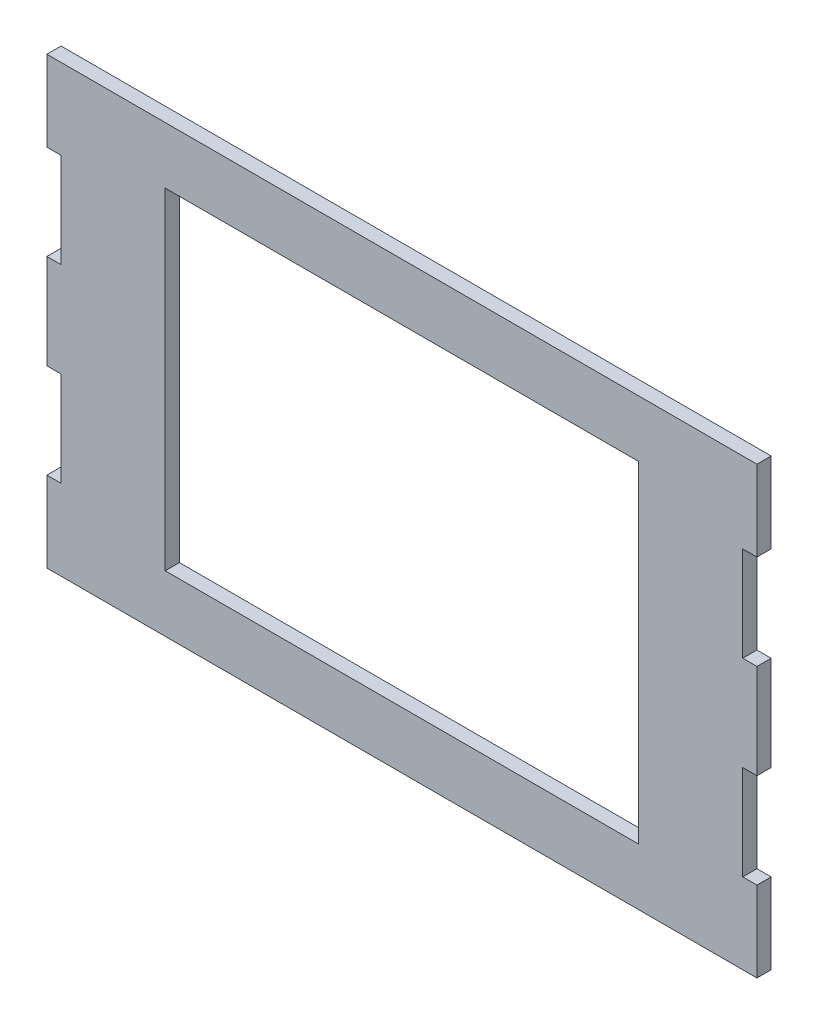
ISO-10303-21;
HEADER;
FILE_DESCRIPTION(('STEP AP214'),'2;1');
FILE_NAME('part.step','',(''),(''),'','','');
FILE_SCHEMA(('AUTOMOTIVE_DESIGN { 1 0 10303 214 1 1 1 1 }'));
ENDSEC;
DATA;
#1=APPLICATION_CONTEXT('core data for automotive mechanical design processes');
#2=APPLICATION_PROTOCOL_DEFINITION('international standard','automotive_design',2000,#1);
#3=PRODUCT_CONTEXT('',#1,'mechanical');
#4=PRODUCT('Part','Part','',(#3));
#5=PRODUCT_RELATED_PRODUCT_CATEGORY('part','',(#4));
#6=PRODUCT_DEFINITION_FORMATION('','',#4);
#7=PRODUCT_DEFINITION_CONTEXT('part definition',#1,'design');
#8=PRODUCT_DEFINITION('design','',#6,#7);
#9=PRODUCT_DEFINITION_SHAPE('','',#8);
#10=(LENGTH_UNIT() NAMED_UNIT(*) SI_UNIT(.MILLI.,.METRE.));
#11=(NAMED_UNIT(*) PLANE_ANGLE_UNIT() SI_UNIT($,.RADIAN.));
#12=(NAMED_UNIT(*) SI_UNIT($,.STERADIAN.) SOLID_ANGLE_UNIT());
#13=UNCERTAINTY_MEASURE_WITH_UNIT(LENGTH_MEASURE(1.E-05),#10,'distance_accuracy_value','');
#14=(GEOMETRIC_REPRESENTATION_CONTEXT(3) GLOBAL_UNCERTAINTY_ASSIGNED_CONTEXT((#13)) GLOBAL_UNIT_ASSIGNED_CONTEXT((#10,
#11,#12)) REPRESENTATION_CONTEXT('',''));
#15=CARTESIAN_POINT('',(0.,0.,0.));
#16=DIRECTION('',(0.,0.,1.));
#17=DIRECTION('',(1.,0.,0.));
#18=AXIS2_PLACEMENT_3D('',#15,#16,#17);
#19=CARTESIAN_POINT('',(75.,-50.,3.));
#20=DIRECTION('',(-1.,0.,0.));
#21=DIRECTION('',(0.,0.,1.));
#22=AXIS2_PLACEMENT_3D('',#19,#20,#21);
#23=PLANE('',#22);
#24=DIRECTION('',(-1.76932311390028E-12,0.,1.));
#25=VECTOR('',#24,1.);
#26=CARTESIAN_POINT('',(75.0000000008151,-47.0000000001453,-396.999999999999));
#27=LINE('',#26,#25);
#28=CARTESIAN_POINT('',(75.0000000001127,-47.0000000001452,8.32667268468867E-13));
#29=VERTEX_POINT('',#28);
#30=CARTESIAN_POINT('',(75.0000000001073,-47.0000000001452,3.00000000000084));
#31=VERTEX_POINT('',#30);
#32=EDGE_CURVE('E329',#29,#31,#27,.T.);
#33=ORIENTED_EDGE('',*,*,#32,.F.);
#34=DIRECTION('',(0.,1.,0.));
#35=VECTOR('',#34,1.);
#36=CARTESIAN_POINT('',(75.,-50.,0.));
#37=LINE('',#36,#35);
#38=CARTESIAN_POINT('',(75.0000000000929,-30.0000000001452,8.32667268468867E-13));
#39=VERTEX_POINT('',#38);
#40=EDGE_CURVE('E351',#29,#39,#37,.T.);
#41=ORIENTED_EDGE('',*,*,#40,.T.);
#42=DIRECTION('',(-1.76932311390034E-12,0.,1.));
#43=VECTOR('',#42,1.);
#44=CARTESIAN_POINT('',(75.0000000000876,-30.000000000145,3.00000000000084));
#45=LINE('',#44,#43);
#46=CARTESIAN_POINT('',(75.0000000000876,-30.000000000145,3.00000000000084));
#47=VERTEX_POINT('',#46);
#48=EDGE_CURVE('E264',#39,#47,#45,.T.);
#49=ORIENTED_EDGE('',*,*,#48,.T.);
#50=DIRECTION('',(0.,1.,0.));
#51=VECTOR('',#50,1.);
#52=CARTESIAN_POINT('',(75.,-50.,3.));
#53=LINE('',#52,#51);
#54=EDGE_CURVE('E342',#31,#47,#53,.T.);
#55=ORIENTED_EDGE('',*,*,#54,.F.);
#56=EDGE_LOOP('',(#33,#41,#49,#55));
#57=FACE_BOUND('',#56,.T.);
#58=ADVANCED_FACE('F37',(#57),#23,.F.);
#59=DIRECTION('',(1.76932311390027E-12,0.,-1.));
#60=VECTOR('',#59,1.);
#61=CARTESIAN_POINT('',(74.9999999999926,46.9999999998519,3.00000000000084));
#62=LINE('',#61,#60);
#63=CARTESIAN_POINT('',(74.9999999999926,46.9999999998519,3.00000000000084));
#64=VERTEX_POINT('',#63);
#65=CARTESIAN_POINT('',(74.9999999999968,46.999999999855,8.32667268468867E-13));
#66=VERTEX_POINT('',#65);
#67=EDGE_CURVE('E229',#64,#66,#62,.T.);
#68=ORIENTED_EDGE('',*,*,#67,.F.);
#69=CARTESIAN_POINT('',(75.0000000000127,29.999999999855,3.00000000000084));
#70=VERTEX_POINT('',#69);
#71=EDGE_CURVE('E337',#70,#64,#53,.T.);
#72=ORIENTED_EDGE('',*,*,#71,.F.);
#73=DIRECTION('',(1.76932311390027E-12,0.,-1.));
#74=VECTOR('',#73,1.);
#75=CARTESIAN_POINT('',(75.0000000000127,29.999999999855,3.00000000000084));
#76=LINE('',#75,#74);
#77=CARTESIAN_POINT('',(75.000000000018,29.999999999855,8.32667268468867E-13));
#78=VERTEX_POINT('',#77);
#79=EDGE_CURVE('E247',#70,#78,#76,.T.);
#80=ORIENTED_EDGE('',*,*,#79,.T.);
#81=EDGE_CURVE('E336',#78,#66,#37,.T.);
#82=ORIENTED_EDGE('',*,*,#81,.T.);
#83=EDGE_LOOP('',(#68,#72,#80,#82));
#84=FACE_BOUND('',#83,.T.);
#85=ADVANCED_FACE('F412',(#84),#23,.F.);
#86=CARTESIAN_POINT('',(75.0000000000679,-10.0000000001452,8.04911692853238E-13));
#87=VERTEX_POINT('',#86);
#88=CARTESIAN_POINT('',(75.000000000043,9.99999999985498,8.04911692853238E-13));
#89=VERTEX_POINT('',#88);
#90=EDGE_CURVE('E350',#87,#89,#37,.T.);
#91=ORIENTED_EDGE('',*,*,#90,.T.);
#92=DIRECTION('',(-1.76932311390027E-12,0.,1.));
#93=VECTOR('',#92,1.);
#94=CARTESIAN_POINT('',(75.0000000000377,9.99999999985498,3.00000000000084));
#95=LINE('',#94,#93);
#96=CARTESIAN_POINT('',(75.0000000000377,9.99999999985498,3.00000000000084));
#97=VERTEX_POINT('',#96);
#98=EDGE_CURVE('E265',#89,#97,#95,.T.);
#99=ORIENTED_EDGE('',*,*,#98,.T.);
#100=CARTESIAN_POINT('',(75.0000000000626,-10.0000000001452,3.00000000000084));
#101=VERTEX_POINT('',#100);
#102=EDGE_CURVE('E340',#101,#97,#53,.T.);
#103=ORIENTED_EDGE('',*,*,#102,.F.);
#104=DIRECTION('',(1.76932311390028E-12,0.,-1.));
#105=VECTOR('',#104,1.);
#106=CARTESIAN_POINT('',(75.0000000000626,-10.0000000001452,3.00000000000084));
#107=LINE('',#106,#105);
#108=EDGE_CURVE('E246',#101,#87,#107,.T.);
#109=ORIENTED_EDGE('',*,*,#108,.T.);
#110=EDGE_LOOP('',(#91,#99,#103,#109));
#111=FACE_BOUND('',#110,.T.);
#112=ADVANCED_FACE('F421',(#111),#23,.F.);
#113=CARTESIAN_POINT('',(-75.,-50.,3.));
#114=DIRECTION('',(1.,0.,0.));
#115=DIRECTION('',(0.,0.,-1.));
#116=AXIS2_PLACEMENT_3D('',#113,#114,#115);
#117=PLANE('',#116);
#118=DIRECTION('',(1.76932311390028E-12,0.,-1.));
#119=VECTOR('',#118,1.);
#120=CARTESIAN_POINT('',(-74.9999999991849,-47.000000000332,-397.000000000265));
#121=LINE('',#120,#119);
#122=CARTESIAN_POINT('',(-74.9999999998927,-47.000000000332,2.99999999973544));
#123=VERTEX_POINT('',#122);
#124=CARTESIAN_POINT('',(-74.9999999998819,-47.0000000003334,-2.65454325187875E-10));
#125=VERTEX_POINT('',#124);
#126=EDGE_CURVE('E333',#123,#125,#121,.T.);
#127=ORIENTED_EDGE('',*,*,#126,.F.);
#128=DIRECTION('',(0.,-1.,0.));
#129=VECTOR('',#128,1.);
#130=CARTESIAN_POINT('',(-75.,-50.,3.));
#131=LINE('',#130,#129);
#132=CARTESIAN_POINT('',(-74.9999999999084,-30.0000000003334,2.99999999973455));
#133=VERTEX_POINT('',#132);
#134=EDGE_CURVE('E343',#133,#123,#131,.T.);
#135=ORIENTED_EDGE('',*,*,#134,.F.);
#136=DIRECTION('',(-1.76932311390034E-12,0.,1.));
#137=VECTOR('',#136,1.);
#138=CARTESIAN_POINT('',(-74.9999999999084,-30.0000000003334,2.99999999973455));
#139=LINE('',#138,#137);
#140=CARTESIAN_POINT('',(-74.9999999999031,-30.0000000003335,-2.65454325187875E-10));
#141=VERTEX_POINT('',#140);
#142=EDGE_CURVE('E322',#141,#133,#139,.T.);
#143=ORIENTED_EDGE('',*,*,#142,.F.);
#144=DIRECTION('',(0.,-1.,0.));
#145=VECTOR('',#144,1.);
#146=CARTESIAN_POINT('',(-75.,-50.,0.));
#147=LINE('',#146,#145);
#148=EDGE_CURVE('E352',#141,#125,#147,.T.);
#149=ORIENTED_EDGE('',*,*,#148,.T.);
#150=EDGE_LOOP('',(#127,#135,#143,#149));
#151=FACE_BOUND('',#150,.T.);
#152=ADVANCED_FACE('F445',(#151),#117,.F.);
#153=DIRECTION('',(1.76932311390028E-12,0.,-1.));
#154=VECTOR('',#153,1.);
#155=CARTESIAN_POINT('',(-74.9999999999334,-10.0000000003335,2.99999999973455));
#156=LINE('',#155,#154);
#157=CARTESIAN_POINT('',(-74.9999999999334,-10.0000000003335,2.99999999973455));
#158=VERTEX_POINT('',#157);
#159=CARTESIAN_POINT('',(-74.9999999999281,-10.0000000003335,-2.65482080763491E-10));
#160=VERTEX_POINT('',#159);
#161=EDGE_CURVE('E315',#158,#160,#156,.T.);
#162=ORIENTED_EDGE('',*,*,#161,.F.);
#163=CARTESIAN_POINT('',(-74.9999999999583,9.99999999966665,2.99999999973455));
#164=VERTEX_POINT('',#163);
#165=EDGE_CURVE('E346',#164,#158,#131,.T.);
#166=ORIENTED_EDGE('',*,*,#165,.F.);
#167=DIRECTION('',(-1.76932311390027E-12,0.,1.));
#168=VECTOR('',#167,1.);
#169=CARTESIAN_POINT('',(-74.9999999999583,9.99999999966665,2.99999999973455));
#170=LINE('',#169,#168);
#171=CARTESIAN_POINT('',(-74.999999999953,9.99999999966665,-2.65482080763491E-10));
#172=VERTEX_POINT('',#171);
#173=EDGE_CURVE('E302',#172,#164,#170,.T.);
#174=ORIENTED_EDGE('',*,*,#173,.F.);
#175=EDGE_CURVE('E355',#172,#160,#147,.T.);
#176=ORIENTED_EDGE('',*,*,#175,.T.);
#177=EDGE_LOOP('',(#162,#166,#174,#176));
#178=FACE_BOUND('',#177,.T.);
#179=ADVANCED_FACE('F394',(#178),#117,.F.);
#180=DIRECTION('',(1.76932311390027E-12,0.,-1.));
#181=VECTOR('',#180,1.);
#182=CARTESIAN_POINT('',(-74.9999999999833,29.9999999996666,2.99999999973455));
#183=LINE('',#182,#181);
#184=CARTESIAN_POINT('',(-74.9999999999833,29.9999999996666,2.99999999973455));
#185=VERTEX_POINT('',#184);
#186=CARTESIAN_POINT('',(-74.999999999978,29.9999999996666,-2.65454325187875E-10));
#187=VERTEX_POINT('',#186);
#188=EDGE_CURVE('E290',#185,#187,#183,.T.);
#189=ORIENTED_EDGE('',*,*,#188,.F.);
#190=CARTESIAN_POINT('',(-75.0000000000074,46.9999999996652,2.99999999973544));
#191=VERTEX_POINT('',#190);
#192=EDGE_CURVE('E347',#191,#185,#131,.T.);
#193=ORIENTED_EDGE('',*,*,#192,.F.);
#194=DIRECTION('',(-1.76932311390027E-12,0.,1.));
#195=VECTOR('',#194,1.);
#196=CARTESIAN_POINT('',(-75.0000000000074,46.9999999996652,2.99999999973544));
#197=LINE('',#196,#195);
#198=CARTESIAN_POINT('',(-75.0000000000021,46.9999999996652,-2.65454325187875E-10));
#199=VERTEX_POINT('',#198);
#200=EDGE_CURVE('E235',#199,#191,#197,.T.);
#201=ORIENTED_EDGE('',*,*,#200,.F.);
#202=EDGE_CURVE('E341',#199,#187,#147,.T.);
#203=ORIENTED_EDGE('',*,*,#202,.T.);
#204=EDGE_LOOP('',(#189,#193,#201,#203));
#205=FACE_BOUND('',#204,.T.);
#206=ADVANCED_FACE('F389',(#205),#117,.F.);
#207=CARTESIAN_POINT('',(0.,0.,3.));
#208=DIRECTION('',(0.,0.,-1.));
#209=DIRECTION('',(-1.,0.,0.));
#210=AXIS2_PLACEMENT_3D('',#207,#208,#209);
#211=PLANE('',#210);
#212=DIRECTION('',(-1.,0.,0.));
#213=VECTOR('',#212,1.);
#214=CARTESIAN_POINT('',(-50.,35.,3.));
#215=LINE('',#214,#213);
#216=CARTESIAN_POINT('',(50.,35.,3.));
#217=VERTEX_POINT('',#216);
#218=CARTESIAN_POINT('',(-50.,35.,3.));
#219=VERTEX_POINT('',#218);
#220=EDGE_CURVE('E223',#217,#219,#215,.T.);
#221=ORIENTED_EDGE('',*,*,#220,.F.);
#222=DIRECTION('',(0.,1.,0.));
#223=VECTOR('',#222,1.);
#224=CARTESIAN_POINT('',(50.,-35.,3.));
#225=LINE('',#224,#223);
#226=CARTESIAN_POINT('',(50.,-35.,3.));
#227=VERTEX_POINT('',#226);
#228=EDGE_CURVE('E51',#227,#217,#225,.T.);
#229=ORIENTED_EDGE('',*,*,#228,.F.);
#230=DIRECTION('',(1.,0.,0.));
#231=VECTOR('',#230,1.);
#232=CARTESIAN_POINT('',(-50.,-35.,3.));
#233=LINE('',#232,#231);
#234=CARTESIAN_POINT('',(-50.,-35.,3.));
#235=VERTEX_POINT('',#234);
#236=EDGE_CURVE('E214',#235,#227,#233,.T.);
#237=ORIENTED_EDGE('',*,*,#236,.F.);
#238=DIRECTION('',(0.,-1.,0.));
#239=VECTOR('',#238,1.);
#240=CARTESIAN_POINT('',(-50.,-35.,3.));
#241=LINE('',#240,#239);
#242=EDGE_CURVE('E217',#219,#235,#241,.T.);
#243=ORIENTED_EDGE('',*,*,#242,.F.);
#244=EDGE_LOOP('',(#221,#229,#237,#243));
#245=FACE_BOUND('',#244,.T.);
#246=DIRECTION('',(-1.,-1.24480111913359E-12,-1.76932311390027E-12));
#247=VECTOR('',#246,1.);
#248=CARTESIAN_POINT('',(-74.9999999998927,-47.000000000332,2.99999999973544));
#249=LINE('',#248,#247);
#250=EDGE_CURVE('E331',#31,#123,#249,.T.);
#251=ORIENTED_EDGE('',*,*,#250,.F.);
#252=ORIENTED_EDGE('',*,*,#54,.T.);
#253=DIRECTION('',(1.,1.24829260047243E-12,1.76932311390027E-12));
#254=VECTOR('',#253,1.);
#255=CARTESIAN_POINT('',(72.0000000000876,-30.0000000001488,2.99999999999553));
#256=LINE('',#255,#254);
#257=CARTESIAN_POINT('',(72.0000000000876,-30.0000000001488,2.99999999999553));
#258=VERTEX_POINT('',#257);
#259=EDGE_CURVE('E278',#258,#47,#256,.T.);
#260=ORIENTED_EDGE('',*,*,#259,.F.);
#261=DIRECTION('',(1.24829260047243E-12,-1.,0.));
#262=VECTOR('',#261,1.);
#263=CARTESIAN_POINT('',(72.0000000001126,-50.0000000001488,2.99999999999559));
#264=LINE('',#263,#262);
#265=CARTESIAN_POINT('',(72.0000000000626,-10.0000000001489,2.99999999999553));
#266=VERTEX_POINT('',#265);
#267=EDGE_CURVE('E250',#266,#258,#264,.T.);
#268=ORIENTED_EDGE('',*,*,#267,.F.);
#269=DIRECTION('',(1.,1.24829260047243E-12,1.76932311390027E-12));
#270=VECTOR('',#269,1.);
#271=CARTESIAN_POINT('',(72.0000000000626,-10.0000000001489,2.99999999999553));
#272=LINE('',#271,#270);
#273=EDGE_CURVE('E253',#266,#101,#272,.T.);
#274=ORIENTED_EDGE('',*,*,#273,.T.);
#275=ORIENTED_EDGE('',*,*,#102,.T.);
#276=DIRECTION('',(1.,1.24829260047243E-12,1.76932311390027E-12));
#277=VECTOR('',#276,1.);
#278=CARTESIAN_POINT('',(72.0000000000377,9.99999999985123,2.99999999999553));
#279=LINE('',#278,#277);
#280=CARTESIAN_POINT('',(72.0000000000377,9.99999999985123,2.99999999999553));
#281=VERTEX_POINT('',#280);
#282=EDGE_CURVE('E262',#281,#97,#279,.T.);
#283=ORIENTED_EDGE('',*,*,#282,.F.);
#284=CARTESIAN_POINT('',(72.0000000000127,29.9999999998512,2.99999999999553));
#285=VERTEX_POINT('',#284);
#286=EDGE_CURVE('E286',#285,#281,#264,.T.);
#287=ORIENTED_EDGE('',*,*,#286,.F.);
#288=DIRECTION('',(1.,1.24829260047243E-12,1.76932311390027E-12));
#289=VECTOR('',#288,1.);
#290=CARTESIAN_POINT('',(72.0000000000127,29.9999999998512,2.99999999999553));
#291=LINE('',#290,#289);
#292=EDGE_CURVE('E240',#285,#70,#291,.T.);
#293=ORIENTED_EDGE('',*,*,#292,.T.);
#294=ORIENTED_EDGE('',*,*,#71,.T.);
#295=DIRECTION('',(1.,1.24480111913359E-12,1.76932311390027E-12));
#296=VECTOR('',#295,1.);
#297=CARTESIAN_POINT('',(-75.0000000000074,46.9999999996652,2.99999999973544));
#298=LINE('',#297,#296);
#299=EDGE_CURVE('E237',#191,#64,#298,.T.);
#300=ORIENTED_EDGE('',*,*,#299,.F.);
#301=ORIENTED_EDGE('',*,*,#192,.T.);
#302=DIRECTION('',(1.,1.24829260047243E-12,1.76932311390027E-12));
#303=VECTOR('',#302,1.);
#304=CARTESIAN_POINT('',(-74.9999999999833,29.9999999996666,2.99999999973455));
#305=LINE('',#304,#303);
#306=CARTESIAN_POINT('',(-71.9999999999833,29.9999999996704,2.99999999973985));
#307=VERTEX_POINT('',#306);
#308=EDGE_CURVE('E287',#185,#307,#305,.T.);
#309=ORIENTED_EDGE('',*,*,#308,.T.);
#310=DIRECTION('',(1.24829260047243E-12,-1.,0.));
#311=VECTOR('',#310,1.);
#312=CARTESIAN_POINT('',(-71.9999999998834,-50.0000000003296,2.9999999997399));
#313=LINE('',#312,#311);
#314=CARTESIAN_POINT('',(-71.9999999999583,9.99999999967039,2.99999999973985));
#315=VERTEX_POINT('',#314);
#316=EDGE_CURVE('E280',#307,#315,#313,.T.);
#317=ORIENTED_EDGE('',*,*,#316,.T.);
#318=DIRECTION('',(1.,1.24829260047243E-12,1.76932311390027E-12));
#319=VECTOR('',#318,1.);
#320=CARTESIAN_POINT('',(-74.9999999999583,9.99999999966665,2.99999999973455));
#321=LINE('',#320,#319);
#322=EDGE_CURVE('E309',#164,#315,#321,.T.);
#323=ORIENTED_EDGE('',*,*,#322,.F.);
#324=ORIENTED_EDGE('',*,*,#165,.T.);
#325=DIRECTION('',(1.,1.24829260047243E-12,1.76932311390027E-12));
#326=VECTOR('',#325,1.);
#327=CARTESIAN_POINT('',(-74.9999999999334,-10.0000000003335,2.99999999973455));
#328=LINE('',#327,#326);
#329=CARTESIAN_POINT('',(-71.9999999999334,-10.0000000003297,2.99999999973985));
#330=VERTEX_POINT('',#329);
#331=EDGE_CURVE('E299',#158,#330,#328,.T.);
#332=ORIENTED_EDGE('',*,*,#331,.T.);
#333=CARTESIAN_POINT('',(-71.9999999999084,-30.0000000003296,2.99999999973985));
#334=VERTEX_POINT('',#333);
#335=EDGE_CURVE('E297',#330,#334,#313,.T.);
#336=ORIENTED_EDGE('',*,*,#335,.T.);
#337=DIRECTION('',(1.,1.24829260047243E-12,1.76932311390027E-12));
#338=VECTOR('',#337,1.);
#339=CARTESIAN_POINT('',(-74.9999999999084,-30.0000000003334,2.99999999973455));
#340=LINE('',#339,#338);
#341=EDGE_CURVE('E239',#133,#334,#340,.T.);
#342=ORIENTED_EDGE('',*,*,#341,.F.);
#343=ORIENTED_EDGE('',*,*,#134,.T.);
#344=EDGE_LOOP('',(#251,#252,#260,#268,#274,#275,#283,#287,#293,#294,#300,#301,#309,#317,#323,
#324,#332,#336,#342,#343));
#345=FACE_BOUND('',#344,.T.);
#346=ADVANCED_FACE('F381',(#245,#345),#211,.F.);
#347=CARTESIAN_POINT('',(0.,0.,0.));
#348=DIRECTION('',(0.,0.,-1.));
#349=DIRECTION('',(-1.,0.,0.));
#350=AXIS2_PLACEMENT_3D('',#347,#348,#349);
#351=PLANE('',#350);
#352=DIRECTION('',(0.,1.,0.));
#353=VECTOR('',#352,1.);
#354=CARTESIAN_POINT('',(50.,-35.,0.));
#355=LINE('',#354,#353);
#356=CARTESIAN_POINT('',(50.,-35.,0.));
#357=VERTEX_POINT('',#356);
#358=CARTESIAN_POINT('',(50.,35.,0.));
#359=VERTEX_POINT('',#358);
#360=EDGE_CURVE('E198',#357,#359,#355,.T.);
#361=ORIENTED_EDGE('',*,*,#360,.T.);
#362=DIRECTION('',(-1.,0.,0.));
#363=VECTOR('',#362,1.);
#364=CARTESIAN_POINT('',(-50.,35.,0.));
#365=LINE('',#364,#363);
#366=CARTESIAN_POINT('',(-50.,35.,0.));
#367=VERTEX_POINT('',#366);
#368=EDGE_CURVE('E207',#359,#367,#365,.T.);
#369=ORIENTED_EDGE('',*,*,#368,.T.);
#370=DIRECTION('',(0.,-1.,0.));
#371=VECTOR('',#370,1.);
#372=CARTESIAN_POINT('',(-50.,-35.,0.));
#373=LINE('',#372,#371);
#374=CARTESIAN_POINT('',(-50.,-35.,0.));
#375=VERTEX_POINT('',#374);
#376=EDGE_CURVE('E59',#367,#375,#373,.T.);
#377=ORIENTED_EDGE('',*,*,#376,.T.);
#378=DIRECTION('',(1.,0.,0.));
#379=VECTOR('',#378,1.);
#380=CARTESIAN_POINT('',(-50.,-35.,0.));
#381=LINE('',#380,#379);
#382=EDGE_CURVE('E204',#375,#357,#381,.T.);
#383=ORIENTED_EDGE('',*,*,#382,.T.);
#384=EDGE_LOOP('',(#361,#369,#377,#383));
#385=FACE_BOUND('',#384,.T.);
#386=DIRECTION('',(1.,1.24480111913359E-12,0.));
#387=VECTOR('',#386,1.);
#388=CARTESIAN_POINT('',(5.85056525995756E-11,-47.0000000002386,0.));
#389=LINE('',#388,#387);
#390=EDGE_CURVE('E11',#125,#29,#389,.T.);
#391=ORIENTED_EDGE('',*,*,#390,.F.);
#392=ORIENTED_EDGE('',*,*,#148,.F.);
#393=DIRECTION('',(1.,1.24829260047243E-12,1.76932311390027E-12));
#394=VECTOR('',#393,1.);
#395=CARTESIAN_POINT('',(-74.9999999999031,-30.0000000003335,-2.65454325187875E-10));
#396=LINE('',#395,#394);
#397=CARTESIAN_POINT('',(-71.9999999999031,-30.0000000003298,-2.6015301024529E-10));
#398=VERTEX_POINT('',#397);
#399=EDGE_CURVE('E319',#141,#398,#396,.T.);
#400=ORIENTED_EDGE('',*,*,#399,.T.);
#401=DIRECTION('',(-1.24829260047243E-12,1.,0.));
#402=VECTOR('',#401,1.);
#403=CARTESIAN_POINT('',(-71.9999999999405,-8.98770672339407E-11,0.));
#404=LINE('',#403,#402);
#405=CARTESIAN_POINT('',(-71.9999999999281,-10.0000000003298,0.));
#406=VERTEX_POINT('',#405);
#407=EDGE_CURVE('E44',#398,#406,#404,.T.);
#408=ORIENTED_EDGE('',*,*,#407,.T.);
#409=DIRECTION('',(1.,1.24829260047243E-12,1.76932311390027E-12));
#410=VECTOR('',#409,1.);
#411=CARTESIAN_POINT('',(-74.9999999999281,-10.0000000003335,-2.65482080763491E-10));
#412=LINE('',#411,#410);
#413=EDGE_CURVE('E303',#160,#406,#412,.T.);
#414=ORIENTED_EDGE('',*,*,#413,.F.);
#415=ORIENTED_EDGE('',*,*,#175,.F.);
#416=DIRECTION('',(1.,1.24829260047243E-12,1.76932311390027E-12));
#417=VECTOR('',#416,1.);
#418=CARTESIAN_POINT('',(-74.999999999953,9.99999999966665,-2.65482080763491E-10));
#419=LINE('',#418,#417);
#420=CARTESIAN_POINT('',(-71.999999999953,9.99999999967039,-2.60180765820905E-10));
#421=VERTEX_POINT('',#420);
#422=EDGE_CURVE('E306',#172,#421,#419,.T.);
#423=ORIENTED_EDGE('',*,*,#422,.T.);
#424=CARTESIAN_POINT('',(-71.999999999978,29.9999999996704,0.));
#425=VERTEX_POINT('',#424);
#426=EDGE_CURVE('E360',#421,#425,#404,.T.);
#427=ORIENTED_EDGE('',*,*,#426,.T.);
#428=DIRECTION('',(1.,1.24829260047243E-12,1.76932311390027E-12));
#429=VECTOR('',#428,1.);
#430=CARTESIAN_POINT('',(-74.999999999978,29.9999999996666,-2.65454325187875E-10));
#431=LINE('',#430,#429);
#432=EDGE_CURVE('E291',#187,#425,#431,.T.);
#433=ORIENTED_EDGE('',*,*,#432,.F.);
#434=ORIENTED_EDGE('',*,*,#202,.F.);
#435=DIRECTION('',(-1.,-1.2448011191336E-12,0.));
#436=VECTOR('',#435,1.);
#437=CARTESIAN_POINT('',(-5.85056525989786E-11,46.9999999997586,0.));
#438=LINE('',#437,#436);
#439=EDGE_CURVE('E358',#66,#199,#438,.T.);
#440=ORIENTED_EDGE('',*,*,#439,.F.);
#441=ORIENTED_EDGE('',*,*,#81,.F.);
#442=DIRECTION('',(1.,1.24829260047243E-12,1.76932311390027E-12));
#443=VECTOR('',#442,1.);
#444=CARTESIAN_POINT('',(72.000000000018,29.9999999998512,-4.46864767411626E-12));
#445=LINE('',#444,#443);
#446=CARTESIAN_POINT('',(72.000000000018,29.9999999998512,-4.46864767411626E-12));
#447=VERTEX_POINT('',#446);
#448=EDGE_CURVE('E244',#447,#78,#445,.T.);
#449=ORIENTED_EDGE('',*,*,#448,.F.);
#450=DIRECTION('',(-1.24829260047243E-12,1.,0.));
#451=VECTOR('',#450,1.);
#452=CARTESIAN_POINT('',(72.0000000000555,8.98770672340842E-11,0.));
#453=LINE('',#452,#451);
#454=CARTESIAN_POINT('',(72.000000000043,9.99999999985124,0.));
#455=VERTEX_POINT('',#454);
#456=EDGE_CURVE('E359',#455,#447,#453,.T.);
#457=ORIENTED_EDGE('',*,*,#456,.F.);
#458=DIRECTION('',(1.,1.24829260047243E-12,1.76932311390027E-12));
#459=VECTOR('',#458,1.);
#460=CARTESIAN_POINT('',(72.000000000043,9.99999999985124,-4.49640324973188E-12));
#461=LINE('',#460,#459);
#462=EDGE_CURVE('E259',#455,#89,#461,.T.);
#463=ORIENTED_EDGE('',*,*,#462,.T.);
#464=ORIENTED_EDGE('',*,*,#90,.F.);
#465=DIRECTION('',(1.,1.24829260047243E-12,1.76932311390027E-12));
#466=VECTOR('',#465,1.);
#467=CARTESIAN_POINT('',(72.0000000000679,-10.0000000001489,-4.49640324973188E-12));
#468=LINE('',#467,#466);
#469=CARTESIAN_POINT('',(72.0000000000679,-10.0000000001489,-4.49640324973188E-12));
#470=VERTEX_POINT('',#469);
#471=EDGE_CURVE('E257',#470,#87,#468,.T.);
#472=ORIENTED_EDGE('',*,*,#471,.F.);
#473=CARTESIAN_POINT('',(72.0000000000929,-30.0000000001489,0.));
#474=VERTEX_POINT('',#473);
#475=EDGE_CURVE('E356',#474,#470,#453,.T.);
#476=ORIENTED_EDGE('',*,*,#475,.F.);
#477=DIRECTION('',(1.,1.24829260047243E-12,1.76932311390027E-12));
#478=VECTOR('',#477,1.);
#479=CARTESIAN_POINT('',(72.0000000000929,-30.0000000001489,-4.46864767411626E-12));
#480=LINE('',#479,#478);
#481=EDGE_CURVE('E274',#474,#39,#480,.T.);
#482=ORIENTED_EDGE('',*,*,#481,.T.);
#483=ORIENTED_EDGE('',*,*,#40,.F.);
#484=EDGE_LOOP('',(#391,#392,#400,#408,#414,#415,#423,#427,#433,#434,#440,#441,#449,#457,#463,
#464,#472,#476,#482,#483));
#485=FACE_BOUND('',#484,.T.);
#486=ADVANCED_FACE('F211',(#385,#485),#351,.T.);
#487=CARTESIAN_POINT('',(72.000000000404,-1.48795906151911E-10,-197.000000000004));
#488=DIRECTION('',(-1.,-1.24829260047243E-12,-1.76932311390027E-12));
#489=DIRECTION('',(1.24829260047243E-12,-1.,0.));
#490=AXIS2_PLACEMENT_3D('',#487,#488,#489);
#491=PLANE('',#490);
#492=ORIENTED_EDGE('',*,*,#456,.T.);
#493=DIRECTION('',(1.76932311390027E-12,0.,-1.));
#494=VECTOR('',#493,1.);
#495=CARTESIAN_POINT('',(72.0000000000127,29.9999999998512,2.99999999999553));
#496=LINE('',#495,#494);
#497=EDGE_CURVE('E243',#285,#447,#496,.T.);
#498=ORIENTED_EDGE('',*,*,#497,.F.);
#499=ORIENTED_EDGE('',*,*,#286,.T.);
#500=DIRECTION('',(-1.76932311390027E-12,0.,1.));
#501=VECTOR('',#500,1.);
#502=CARTESIAN_POINT('',(72.0000000000377,9.99999999985123,2.99999999999553));
#503=LINE('',#502,#501);
#504=EDGE_CURVE('E256',#455,#281,#503,.T.);
#505=ORIENTED_EDGE('',*,*,#504,.F.);
#506=EDGE_LOOP('',(#492,#498,#499,#505));
#507=FACE_BOUND('',#506,.T.);
#508=ADVANCED_FACE('F401',(#507),#491,.F.);
#509=CARTESIAN_POINT('',(72.0000000000377,9.99999999985123,2.99999999999553));
#510=DIRECTION('',(-1.24829260047243E-12,1.,0.));
#511=DIRECTION('',(-1.76932311390027E-12,0.,1.));
#512=AXIS2_PLACEMENT_3D('',#509,#510,#511);
#513=PLANE('',#512);
#514=ORIENTED_EDGE('',*,*,#98,.F.);
#515=ORIENTED_EDGE('',*,*,#462,.F.);
#516=ORIENTED_EDGE('',*,*,#504,.T.);
#517=ORIENTED_EDGE('',*,*,#282,.T.);
#518=EDGE_LOOP('',(#514,#515,#516,#517));
#519=FACE_BOUND('',#518,.T.);
#520=ADVANCED_FACE('F418',(#519),#513,.T.);
#521=CARTESIAN_POINT('',(72.0000000000127,29.9999999998512,2.99999999999553));
#522=DIRECTION('',(1.24829260047243E-12,-1.,0.));
#523=DIRECTION('',(1.76932311390027E-12,0.,-1.));
#524=AXIS2_PLACEMENT_3D('',#521,#522,#523);
#525=PLANE('',#524);
#526=ORIENTED_EDGE('',*,*,#79,.F.);
#527=ORIENTED_EDGE('',*,*,#292,.F.);
#528=ORIENTED_EDGE('',*,*,#497,.T.);
#529=ORIENTED_EDGE('',*,*,#448,.T.);
#530=EDGE_LOOP('',(#526,#527,#528,#529));
#531=FACE_BOUND('',#530,.T.);
#532=ADVANCED_FACE('F407',(#531),#525,.T.);
#533=ORIENTED_EDGE('',*,*,#475,.T.);
#534=DIRECTION('',(1.76932311390028E-12,0.,-1.));
#535=VECTOR('',#534,1.);
#536=CARTESIAN_POINT('',(72.0000000000626,-10.0000000001489,2.99999999999553));
#537=LINE('',#536,#535);
#538=EDGE_CURVE('E268',#266,#470,#537,.T.);
#539=ORIENTED_EDGE('',*,*,#538,.F.);
#540=ORIENTED_EDGE('',*,*,#267,.T.);
#541=DIRECTION('',(-1.76932311390034E-12,0.,1.));
#542=VECTOR('',#541,1.);
#543=CARTESIAN_POINT('',(72.0000000000876,-30.0000000001488,2.99999999999553));
#544=LINE('',#543,#542);
#545=EDGE_CURVE('E277',#474,#258,#544,.T.);
#546=ORIENTED_EDGE('',*,*,#545,.F.);
#547=EDGE_LOOP('',(#533,#539,#540,#546));
#548=FACE_BOUND('',#547,.T.);
#549=ADVANCED_FACE('F436',(#548),#491,.F.);
#550=CARTESIAN_POINT('',(72.0000000000876,-30.0000000001488,2.99999999999553));
#551=DIRECTION('',(-1.24829260047234E-12,1.,0.));
#552=DIRECTION('',(-1.76932311390034E-12,0.,1.));
#553=AXIS2_PLACEMENT_3D('',#550,#551,#552);
#554=PLANE('',#553);
#555=ORIENTED_EDGE('',*,*,#48,.F.);
#556=ORIENTED_EDGE('',*,*,#481,.F.);
#557=ORIENTED_EDGE('',*,*,#545,.T.);
#558=ORIENTED_EDGE('',*,*,#259,.T.);
#559=EDGE_LOOP('',(#555,#556,#557,#558));
#560=FACE_BOUND('',#559,.T.);
#561=ADVANCED_FACE('F434',(#560),#554,.T.);
#562=CARTESIAN_POINT('',(72.0000000000626,-10.0000000001489,2.99999999999553));
#563=DIRECTION('',(1.24829260047243E-12,-1.,0.));
#564=DIRECTION('',(1.76932311390028E-12,0.,-1.));
#565=AXIS2_PLACEMENT_3D('',#562,#563,#564);
#566=PLANE('',#565);
#567=ORIENTED_EDGE('',*,*,#108,.F.);
#568=ORIENTED_EDGE('',*,*,#273,.F.);
#569=ORIENTED_EDGE('',*,*,#538,.T.);
#570=ORIENTED_EDGE('',*,*,#471,.T.);
#571=EDGE_LOOP('',(#567,#568,#569,#570));
#572=FACE_BOUND('',#571,.T.);
#573=ADVANCED_FACE('F592',(#572),#566,.T.);
#574=CARTESIAN_POINT('',(3.46483258750752E-10,46.9999999997599,-197.000000000132));
#575=DIRECTION('',(1.2448011191336E-12,-1.,0.));
#576=DIRECTION('',(-1.,-1.24480111913359E-12,-1.76932311390027E-12));
#577=AXIS2_PLACEMENT_3D('',#574,#575,#576);
#578=PLANE('',#577);
#579=ORIENTED_EDGE('',*,*,#439,.T.);
#580=ORIENTED_EDGE('',*,*,#200,.T.);
#581=ORIENTED_EDGE('',*,*,#299,.T.);
#582=ORIENTED_EDGE('',*,*,#67,.T.);
#583=EDGE_LOOP('',(#579,#580,#581,#582));
#584=FACE_BOUND('',#583,.T.);
#585=ADVANCED_FACE('F462',(#584),#578,.F.);
#586=CARTESIAN_POINT('',(-71.999999999592,-3.29639483982233E-10,-197.00000000026));
#587=DIRECTION('',(-1.,-1.24829260047243E-12,-1.76932311390027E-12));
#588=DIRECTION('',(1.24829260047243E-12,-1.,0.));
#589=AXIS2_PLACEMENT_3D('',#586,#587,#588);
#590=PLANE('',#589);
#591=DIRECTION('',(-1.76932311390027E-12,0.,1.));
#592=VECTOR('',#591,1.);
#593=CARTESIAN_POINT('',(-71.9999999999583,9.99999999967039,2.99999999973985));
#594=LINE('',#593,#592);
#595=EDGE_CURVE('E313',#421,#315,#594,.T.);
#596=ORIENTED_EDGE('',*,*,#595,.T.);
#597=ORIENTED_EDGE('',*,*,#316,.F.);
#598=DIRECTION('',(1.76932311390027E-12,0.,-1.));
#599=VECTOR('',#598,1.);
#600=CARTESIAN_POINT('',(-71.9999999999833,29.9999999996704,2.99999999973985));
#601=LINE('',#600,#599);
#602=EDGE_CURVE('E295',#307,#425,#601,.T.);
#603=ORIENTED_EDGE('',*,*,#602,.T.);
#604=ORIENTED_EDGE('',*,*,#426,.F.);
#605=EDGE_LOOP('',(#596,#597,#603,#604));
#606=FACE_BOUND('',#605,.T.);
#607=ADVANCED_FACE('F370',(#606),#590,.T.);
#608=CARTESIAN_POINT('',(-74.9999999999583,9.99999999966665,2.99999999973455));
#609=DIRECTION('',(-1.24829260047243E-12,1.,0.));
#610=DIRECTION('',(-1.76932311390027E-12,0.,1.));
#611=AXIS2_PLACEMENT_3D('',#608,#609,#610);
#612=PLANE('',#611);
#613=ORIENTED_EDGE('',*,*,#595,.F.);
#614=ORIENTED_EDGE('',*,*,#422,.F.);
#615=ORIENTED_EDGE('',*,*,#173,.T.);
#616=ORIENTED_EDGE('',*,*,#322,.T.);
#617=EDGE_LOOP('',(#613,#614,#615,#616));
#618=FACE_BOUND('',#617,.T.);
#619=ADVANCED_FACE('F373',(#618),#612,.T.);
#620=CARTESIAN_POINT('',(-74.9999999999833,29.9999999996666,2.99999999973455));
#621=DIRECTION('',(1.24829260047243E-12,-1.,0.));
#622=DIRECTION('',(1.76932311390027E-12,0.,-1.));
#623=AXIS2_PLACEMENT_3D('',#620,#621,#622);
#624=PLANE('',#623);
#625=ORIENTED_EDGE('',*,*,#602,.F.);
#626=ORIENTED_EDGE('',*,*,#308,.F.);
#627=ORIENTED_EDGE('',*,*,#188,.T.);
#628=ORIENTED_EDGE('',*,*,#432,.T.);
#629=EDGE_LOOP('',(#625,#626,#627,#628));
#630=FACE_BOUND('',#629,.T.);
#631=ADVANCED_FACE('F387',(#630),#624,.T.);
#632=DIRECTION('',(-1.76932311390034E-12,0.,1.));
#633=VECTOR('',#632,1.);
#634=CARTESIAN_POINT('',(-71.9999999999084,-30.0000000003296,2.99999999973985));
#635=LINE('',#634,#633);
#636=EDGE_CURVE('E312',#398,#334,#635,.T.);
#637=ORIENTED_EDGE('',*,*,#636,.T.);
#638=ORIENTED_EDGE('',*,*,#335,.F.);
#639=DIRECTION('',(1.76932311390028E-12,0.,-1.));
#640=VECTOR('',#639,1.);
#641=CARTESIAN_POINT('',(-71.9999999999334,-10.0000000003297,2.99999999973985));
#642=LINE('',#641,#640);
#643=EDGE_CURVE('E294',#330,#406,#642,.T.);
#644=ORIENTED_EDGE('',*,*,#643,.T.);
#645=ORIENTED_EDGE('',*,*,#407,.F.);
#646=EDGE_LOOP('',(#637,#638,#644,#645));
#647=FACE_BOUND('',#646,.T.);
#648=ADVANCED_FACE('F451',(#647),#590,.T.);
#649=CARTESIAN_POINT('',(-74.9999999999084,-30.0000000003334,2.99999999973455));
#650=DIRECTION('',(-1.24829260047234E-12,1.,0.));
#651=DIRECTION('',(-1.76932311390034E-12,0.,1.));
#652=AXIS2_PLACEMENT_3D('',#649,#650,#651);
#653=PLANE('',#652);
#654=ORIENTED_EDGE('',*,*,#636,.F.);
#655=ORIENTED_EDGE('',*,*,#399,.F.);
#656=ORIENTED_EDGE('',*,*,#142,.T.);
#657=ORIENTED_EDGE('',*,*,#341,.T.);
#658=EDGE_LOOP('',(#654,#655,#656,#657));
#659=FACE_BOUND('',#658,.T.);
#660=ADVANCED_FACE('F449',(#659),#653,.T.);
#661=CARTESIAN_POINT('',(-74.9999999999334,-10.0000000003335,2.99999999973455));
#662=DIRECTION('',(1.24829260047243E-12,-1.,0.));
#663=DIRECTION('',(1.76932311390028E-12,0.,-1.));
#664=AXIS2_PLACEMENT_3D('',#661,#662,#663);
#665=PLANE('',#664);
#666=ORIENTED_EDGE('',*,*,#643,.F.);
#667=ORIENTED_EDGE('',*,*,#331,.F.);
#668=ORIENTED_EDGE('',*,*,#161,.T.);
#669=ORIENTED_EDGE('',*,*,#413,.T.);
#670=EDGE_LOOP('',(#666,#667,#668,#669));
#671=FACE_BOUND('',#670,.T.);
#672=ADVANCED_FACE('F396',(#671),#665,.T.);
#673=CARTESIAN_POINT('',(4.61172766641482E-10,-47.0000000002386,-197.000000000132));
#674=DIRECTION('',(-1.24480111913359E-12,1.,0.));
#675=DIRECTION('',(-1.,-1.24480111913359E-12,-1.76932311390027E-12));
#676=AXIS2_PLACEMENT_3D('',#673,#674,#675);
#677=PLANE('',#676);
#678=ORIENTED_EDGE('',*,*,#390,.T.);
#679=ORIENTED_EDGE('',*,*,#32,.T.);
#680=ORIENTED_EDGE('',*,*,#250,.T.);
#681=ORIENTED_EDGE('',*,*,#126,.T.);
#682=EDGE_LOOP('',(#678,#679,#680,#681));
#683=FACE_BOUND('',#682,.T.);
#684=ADVANCED_FACE('F443',(#683),#677,.F.);
#685=CARTESIAN_POINT('',(50.,-35.,0.));
#686=DIRECTION('',(1.,0.,0.));
#687=DIRECTION('',(0.,0.,-1.));
#688=AXIS2_PLACEMENT_3D('',#685,#686,#687);
#689=PLANE('',#688);
#690=ORIENTED_EDGE('',*,*,#228,.T.);
#691=DIRECTION('',(0.,0.,1.));
#692=VECTOR('',#691,1.);
#693=CARTESIAN_POINT('',(50.,35.,0.));
#694=LINE('',#693,#692);
#695=EDGE_CURVE('E194',#359,#217,#694,.T.);
#696=ORIENTED_EDGE('',*,*,#695,.F.);
#697=ORIENTED_EDGE('',*,*,#360,.F.);
#698=DIRECTION('',(0.,0.,1.));
#699=VECTOR('',#698,1.);
#700=CARTESIAN_POINT('',(50.,-35.,0.));
#701=LINE('',#700,#699);
#702=EDGE_CURVE('E227',#357,#227,#701,.T.);
#703=ORIENTED_EDGE('',*,*,#702,.T.);
#704=EDGE_LOOP('',(#690,#696,#697,#703));
#705=FACE_BOUND('',#704,.T.);
#706=ADVANCED_FACE('F196',(#705),#689,.F.);
#707=CARTESIAN_POINT('',(-50.,-35.,0.));
#708=DIRECTION('',(0.,-1.,0.));
#709=DIRECTION('',(0.,0.,-1.));
#710=AXIS2_PLACEMENT_3D('',#707,#708,#709);
#711=PLANE('',#710);
#712=ORIENTED_EDGE('',*,*,#236,.T.);
#713=ORIENTED_EDGE('',*,*,#702,.F.);
#714=ORIENTED_EDGE('',*,*,#382,.F.);
#715=DIRECTION('',(0.,0.,1.));
#716=VECTOR('',#715,1.);
#717=CARTESIAN_POINT('',(-50.,-35.,0.));
#718=LINE('',#717,#716);
#719=EDGE_CURVE('E230',#375,#235,#718,.T.);
#720=ORIENTED_EDGE('',*,*,#719,.T.);
#721=EDGE_LOOP('',(#712,#713,#714,#720));
#722=FACE_BOUND('',#721,.T.);
#723=ADVANCED_FACE('F489',(#722),#711,.F.);
#724=CARTESIAN_POINT('',(-50.,-35.,0.));
#725=DIRECTION('',(-1.,0.,0.));
#726=DIRECTION('',(0.,0.,1.));
#727=AXIS2_PLACEMENT_3D('',#724,#725,#726);
#728=PLANE('',#727);
#729=ORIENTED_EDGE('',*,*,#242,.T.);
#730=ORIENTED_EDGE('',*,*,#719,.F.);
#731=ORIENTED_EDGE('',*,*,#376,.F.);
#732=DIRECTION('',(0.,0.,1.));
#733=VECTOR('',#732,1.);
#734=CARTESIAN_POINT('',(-50.,35.,0.));
#735=LINE('',#734,#733);
#736=EDGE_CURVE('E203',#367,#219,#735,.T.);
#737=ORIENTED_EDGE('',*,*,#736,.T.);
#738=EDGE_LOOP('',(#729,#730,#731,#737));
#739=FACE_BOUND('',#738,.T.);
#740=ADVANCED_FACE('F559',(#739),#728,.F.);
#741=CARTESIAN_POINT('',(-50.,35.,0.));
#742=DIRECTION('',(0.,1.,0.));
#743=DIRECTION('',(0.,0.,1.));
#744=AXIS2_PLACEMENT_3D('',#741,#742,#743);
#745=PLANE('',#744);
#746=ORIENTED_EDGE('',*,*,#220,.T.);
#747=ORIENTED_EDGE('',*,*,#736,.F.);
#748=ORIENTED_EDGE('',*,*,#368,.F.);
#749=ORIENTED_EDGE('',*,*,#695,.T.);
#750=EDGE_LOOP('',(#746,#747,#748,#749));
#751=FACE_BOUND('',#750,.T.);
#752=ADVANCED_FACE('F208',(#751),#745,.F.);
#753=CLOSED_SHELL('',(#58,#85,#112,#152,#179,#206,#346,#486,#508,#520,#532,#549,#561,#573,#585,
#607,#619,#631,#648,#660,#672,#684,#706,#723,#740,#752));
#754=MANIFOLD_SOLID_BREP('B2',#753);
#755=ADVANCED_BREP_SHAPE_REPRESENTATION('',(#18,#754),#14);
#756=SHAPE_DEFINITION_REPRESENTATION(#9,#755);
ENDSEC;
END-ISO-10303-21;
